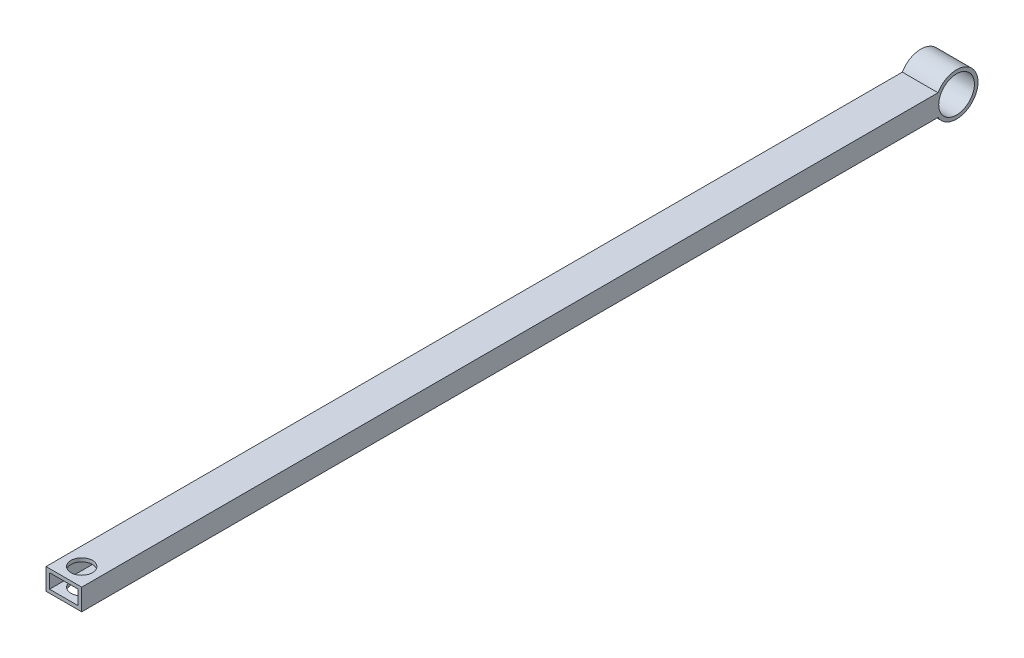
ISO-10303-21;
HEADER;
FILE_DESCRIPTION(('STEP AP214'),'2;1');
FILE_NAME('part.step','',(''),(''),'','','');
FILE_SCHEMA(('AUTOMOTIVE_DESIGN { 1 0 10303 214 1 1 1 1 }'));
ENDSEC;
DATA;
#1=APPLICATION_CONTEXT('core data for automotive mechanical design processes');
#2=APPLICATION_PROTOCOL_DEFINITION('international standard','automotive_design',2000,#1);
#3=PRODUCT_CONTEXT('',#1,'mechanical');
#4=PRODUCT('Part','Part','',(#3));
#5=PRODUCT_RELATED_PRODUCT_CATEGORY('part','',(#4));
#6=PRODUCT_DEFINITION_FORMATION('','',#4);
#7=PRODUCT_DEFINITION_CONTEXT('part definition',#1,'design');
#8=PRODUCT_DEFINITION('design','',#6,#7);
#9=PRODUCT_DEFINITION_SHAPE('','',#8);
#10=(LENGTH_UNIT() NAMED_UNIT(*) SI_UNIT(.MILLI.,.METRE.));
#11=(NAMED_UNIT(*) PLANE_ANGLE_UNIT() SI_UNIT($,.RADIAN.));
#12=(NAMED_UNIT(*) SI_UNIT($,.STERADIAN.) SOLID_ANGLE_UNIT());
#13=UNCERTAINTY_MEASURE_WITH_UNIT(LENGTH_MEASURE(1.E-05),#10,'distance_accuracy_value','');
#14=(GEOMETRIC_REPRESENTATION_CONTEXT(3) GLOBAL_UNCERTAINTY_ASSIGNED_CONTEXT((#13)) GLOBAL_UNIT_ASSIGNED_CONTEXT((#10,
#11,#12)) REPRESENTATION_CONTEXT('',''));
#15=CARTESIAN_POINT('',(0.,0.,0.));
#16=DIRECTION('',(0.,0.,1.));
#17=DIRECTION('',(1.,0.,0.));
#18=AXIS2_PLACEMENT_3D('',#15,#16,#17);
#19=CARTESIAN_POINT('',(0.,0.,250.));
#20=DIRECTION('',(0.,0.,1.));
#21=DIRECTION('',(1.,0.,0.));
#22=AXIS2_PLACEMENT_3D('',#19,#20,#21);
#23=PLANE('',#22);
#24=DIRECTION('',(0.,1.,0.));
#25=VECTOR('',#24,1.);
#26=CARTESIAN_POINT('',(5.,3.,250.));
#27=LINE('',#26,#25);
#28=CARTESIAN_POINT('',(5.,-3.,250.));
#29=VERTEX_POINT('',#28);
#30=CARTESIAN_POINT('',(5.,3.,250.));
#31=VERTEX_POINT('',#30);
#32=EDGE_CURVE('E158',#29,#31,#27,.T.);
#33=ORIENTED_EDGE('',*,*,#32,.T.);
#34=DIRECTION('',(-1.,0.,0.));
#35=VECTOR('',#34,1.);
#36=CARTESIAN_POINT('',(-5.,3.,250.));
#37=LINE('',#36,#35);
#38=CARTESIAN_POINT('',(-5.,3.,250.));
#39=VERTEX_POINT('',#38);
#40=EDGE_CURVE('E162',#31,#39,#37,.T.);
#41=ORIENTED_EDGE('',*,*,#40,.T.);
#42=DIRECTION('',(0.,-1.,0.));
#43=VECTOR('',#42,1.);
#44=CARTESIAN_POINT('',(-5.,3.,250.));
#45=LINE('',#44,#43);
#46=CARTESIAN_POINT('',(-5.,-3.,250.));
#47=VERTEX_POINT('',#46);
#48=EDGE_CURVE('E164',#39,#47,#45,.T.);
#49=ORIENTED_EDGE('',*,*,#48,.T.);
#50=DIRECTION('',(1.,0.,0.));
#51=VECTOR('',#50,1.);
#52=CARTESIAN_POINT('',(-5.,-3.,250.));
#53=LINE('',#52,#51);
#54=EDGE_CURVE('E166',#47,#29,#53,.T.);
#55=ORIENTED_EDGE('',*,*,#54,.T.);
#56=EDGE_LOOP('',(#33,#41,#49,#55));
#57=FACE_BOUND('',#56,.T.);
#58=DIRECTION('',(-1.,0.,0.));
#59=VECTOR('',#58,1.);
#60=CARTESIAN_POINT('',(-4.,2.,250.));
#61=LINE('',#60,#59);
#62=CARTESIAN_POINT('',(4.,2.,250.));
#63=VERTEX_POINT('',#62);
#64=CARTESIAN_POINT('',(-4.,2.,250.));
#65=VERTEX_POINT('',#64);
#66=EDGE_CURVE('E144',#63,#65,#61,.T.);
#67=ORIENTED_EDGE('',*,*,#66,.F.);
#68=DIRECTION('',(0.,1.,0.));
#69=VECTOR('',#68,1.);
#70=CARTESIAN_POINT('',(4.,2.,250.));
#71=LINE('',#70,#69);
#72=CARTESIAN_POINT('',(4.,-2.,250.));
#73=VERTEX_POINT('',#72);
#74=EDGE_CURVE('E142',#73,#63,#71,.T.);
#75=ORIENTED_EDGE('',*,*,#74,.F.);
#76=DIRECTION('',(1.,0.,0.));
#77=VECTOR('',#76,1.);
#78=CARTESIAN_POINT('',(-4.,-2.,250.));
#79=LINE('',#78,#77);
#80=CARTESIAN_POINT('',(-4.,-2.,250.));
#81=VERTEX_POINT('',#80);
#82=EDGE_CURVE('E110',#81,#73,#79,.T.);
#83=ORIENTED_EDGE('',*,*,#82,.F.);
#84=DIRECTION('',(0.,-1.,0.));
#85=VECTOR('',#84,1.);
#86=CARTESIAN_POINT('',(-4.,2.,250.));
#87=LINE('',#86,#85);
#88=EDGE_CURVE('E146',#65,#81,#87,.T.);
#89=ORIENTED_EDGE('',*,*,#88,.F.);
#90=EDGE_LOOP('',(#67,#75,#83,#89));
#91=FACE_BOUND('',#90,.T.);
#92=ADVANCED_FACE('F41',(#57,#91),#23,.T.);
#93=CARTESIAN_POINT('',(0.,249.,245.));
#94=DIRECTION('',(0.,-1.,0.));
#95=DIRECTION('',(0.,0.,-1.));
#96=AXIS2_PLACEMENT_3D('',#93,#94,#95);
#97=CYLINDRICAL_SURFACE('',#96,3.);
#98=CARTESIAN_POINT('',(0.,3.,245.));
#99=DIRECTION('',(0.,-1.,0.));
#100=DIRECTION('',(0.,0.,-1.));
#101=AXIS2_PLACEMENT_3D('',#98,#99,#100);
#102=CIRCLE('',#101,3.);
#103=CARTESIAN_POINT('',(0.,3.,242.));
#104=VERTEX_POINT('',#103);
#105=EDGE_CURVE('E155',#104,#104,#102,.F.);
#106=ORIENTED_EDGE('',*,*,#105,.T.);
#107=EDGE_LOOP('',(#106));
#108=FACE_BOUND('',#107,.T.);
#109=CARTESIAN_POINT('',(0.,2.,245.));
#110=DIRECTION('',(0.,-1.,0.));
#111=DIRECTION('',(0.,0.,-1.));
#112=AXIS2_PLACEMENT_3D('',#109,#110,#111);
#113=CIRCLE('',#112,3.);
#114=CARTESIAN_POINT('',(0.,2.,242.));
#115=VERTEX_POINT('',#114);
#116=EDGE_CURVE('E178',#115,#115,#113,.T.);
#117=ORIENTED_EDGE('',*,*,#116,.T.);
#118=EDGE_LOOP('',(#117));
#119=FACE_BOUND('',#118,.T.);
#120=ADVANCED_FACE('F184',(#108,#119),#97,.F.);
#121=CARTESIAN_POINT('',(0.,-3.,245.));
#122=DIRECTION('',(0.,1.,0.));
#123=DIRECTION('',(0.,0.,1.));
#124=AXIS2_PLACEMENT_3D('',#121,#122,#123);
#125=CIRCLE('',#124,3.);
#126=CARTESIAN_POINT('',(0.,-3.,248.));
#127=VERTEX_POINT('',#126);
#128=EDGE_CURVE('E159',#127,#127,#125,.F.);
#129=ORIENTED_EDGE('',*,*,#128,.T.);
#130=EDGE_LOOP('',(#129));
#131=FACE_BOUND('',#130,.T.);
#132=CARTESIAN_POINT('',(0.,-2.,245.));
#133=DIRECTION('',(0.,1.,0.));
#134=DIRECTION('',(0.,0.,1.));
#135=AXIS2_PLACEMENT_3D('',#132,#133,#134);
#136=CIRCLE('',#135,3.);
#137=CARTESIAN_POINT('',(0.,-2.,248.));
#138=VERTEX_POINT('',#137);
#139=EDGE_CURVE('E154',#138,#138,#136,.T.);
#140=ORIENTED_EDGE('',*,*,#139,.T.);
#141=EDGE_LOOP('',(#140));
#142=FACE_BOUND('',#141,.T.);
#143=ADVANCED_FACE('F204',(#131,#142),#97,.F.);
#144=CARTESIAN_POINT('',(5.,3.,250.));
#145=DIRECTION('',(-1.,0.,0.));
#146=DIRECTION('',(0.,0.,1.));
#147=AXIS2_PLACEMENT_3D('',#144,#145,#146);
#148=PLANE('',#147);
#149=CARTESIAN_POINT('',(5.,0.,5.));
#150=DIRECTION('',(-1.,0.,0.));
#151=DIRECTION('',(0.,-1.,0.));
#152=AXIS2_PLACEMENT_3D('',#149,#150,#151);
#153=CIRCLE('',#152,5.);
#154=CARTESIAN_POINT('',(5.,-5.,5.));
#155=VERTEX_POINT('',#154);
#156=EDGE_CURVE('E232',#155,#155,#153,.T.);
#157=ORIENTED_EDGE('',*,*,#156,.T.);
#158=EDGE_LOOP('',(#157));
#159=FACE_BOUND('',#158,.T.);
#160=DIRECTION('',(0.,0.,-1.));
#161=VECTOR('',#160,1.);
#162=CARTESIAN_POINT('',(5.,-3.,250.));
#163=LINE('',#162,#161);
#164=CARTESIAN_POINT('',(5.,-3.,10.1961524227066));
#165=VERTEX_POINT('',#164);
#166=EDGE_CURVE('E168',#29,#165,#163,.T.);
#167=ORIENTED_EDGE('',*,*,#166,.T.);
#168=CARTESIAN_POINT('',(5.,0.,5.));
#169=DIRECTION('',(-1.,0.,0.));
#170=DIRECTION('',(0.,-1.,0.));
#171=AXIS2_PLACEMENT_3D('',#168,#169,#170);
#172=CIRCLE('',#171,6.);
#173=CARTESIAN_POINT('',(5.,3.,10.1961524227066));
#174=VERTEX_POINT('',#173);
#175=EDGE_CURVE('E131',#174,#165,#172,.T.);
#176=ORIENTED_EDGE('',*,*,#175,.F.);
#177=DIRECTION('',(0.,0.,-1.));
#178=VECTOR('',#177,1.);
#179=CARTESIAN_POINT('',(5.,3.,250.));
#180=LINE('',#179,#178);
#181=EDGE_CURVE('E50',#31,#174,#180,.T.);
#182=ORIENTED_EDGE('',*,*,#181,.F.);
#183=ORIENTED_EDGE('',*,*,#32,.F.);
#184=EDGE_LOOP('',(#167,#176,#182,#183));
#185=FACE_BOUND('',#184,.T.);
#186=ADVANCED_FACE('F43',(#159,#185),#148,.F.);
#187=CARTESIAN_POINT('',(-5.,3.,250.));
#188=DIRECTION('',(0.,-1.,0.));
#189=DIRECTION('',(0.,0.,-1.));
#190=AXIS2_PLACEMENT_3D('',#187,#188,#189);
#191=PLANE('',#190);
#192=ORIENTED_EDGE('',*,*,#105,.F.);
#193=EDGE_LOOP('',(#192));
#194=FACE_BOUND('',#193,.T.);
#195=ORIENTED_EDGE('',*,*,#181,.T.);
#196=DIRECTION('',(-1.,0.,0.));
#197=VECTOR('',#196,1.);
#198=CARTESIAN_POINT('',(5.,3.,10.1961524227066));
#199=LINE('',#198,#197);
#200=CARTESIAN_POINT('',(-5.,3.,10.1961524227066));
#201=VERTEX_POINT('',#200);
#202=EDGE_CURVE('E60',#174,#201,#199,.T.);
#203=ORIENTED_EDGE('',*,*,#202,.T.);
#204=DIRECTION('',(0.,0.,-1.));
#205=VECTOR('',#204,1.);
#206=CARTESIAN_POINT('',(-5.,3.,250.));
#207=LINE('',#206,#205);
#208=EDGE_CURVE('E173',#39,#201,#207,.T.);
#209=ORIENTED_EDGE('',*,*,#208,.F.);
#210=ORIENTED_EDGE('',*,*,#40,.F.);
#211=EDGE_LOOP('',(#195,#203,#209,#210));
#212=FACE_BOUND('',#211,.T.);
#213=ADVANCED_FACE('F215',(#194,#212),#191,.F.);
#214=CARTESIAN_POINT('',(-5.,3.,250.));
#215=DIRECTION('',(1.,0.,0.));
#216=DIRECTION('',(0.,1.,0.));
#217=AXIS2_PLACEMENT_3D('',#214,#215,#216);
#218=PLANE('',#217);
#219=CARTESIAN_POINT('',(-5.,0.,5.));
#220=DIRECTION('',(1.,0.,0.));
#221=DIRECTION('',(0.,1.,0.));
#222=AXIS2_PLACEMENT_3D('',#219,#220,#221);
#223=CIRCLE('',#222,5.);
#224=CARTESIAN_POINT('',(-5.,5.,5.));
#225=VERTEX_POINT('',#224);
#226=EDGE_CURVE('E45',#225,#225,#223,.T.);
#227=ORIENTED_EDGE('',*,*,#226,.T.);
#228=EDGE_LOOP('',(#227));
#229=FACE_BOUND('',#228,.T.);
#230=ORIENTED_EDGE('',*,*,#208,.T.);
#231=CARTESIAN_POINT('',(-5.,0.,5.));
#232=DIRECTION('',(-1.,0.,0.));
#233=DIRECTION('',(0.,-1.,0.));
#234=AXIS2_PLACEMENT_3D('',#231,#232,#233);
#235=CIRCLE('',#234,6.);
#236=CARTESIAN_POINT('',(-5.,-3.,10.1961524227066));
#237=VERTEX_POINT('',#236);
#238=EDGE_CURVE('E134',#201,#237,#235,.T.);
#239=ORIENTED_EDGE('',*,*,#238,.T.);
#240=DIRECTION('',(0.,0.,-1.));
#241=VECTOR('',#240,1.);
#242=CARTESIAN_POINT('',(-5.,-3.,250.));
#243=LINE('',#242,#241);
#244=EDGE_CURVE('E171',#47,#237,#243,.T.);
#245=ORIENTED_EDGE('',*,*,#244,.F.);
#246=ORIENTED_EDGE('',*,*,#48,.F.);
#247=EDGE_LOOP('',(#230,#239,#245,#246));
#248=FACE_BOUND('',#247,.T.);
#249=ADVANCED_FACE('F212',(#229,#248),#218,.F.);
#250=CARTESIAN_POINT('',(-5.,-3.,250.));
#251=DIRECTION('',(0.,1.,0.));
#252=DIRECTION('',(0.,0.,1.));
#253=AXIS2_PLACEMENT_3D('',#250,#251,#252);
#254=PLANE('',#253);
#255=ORIENTED_EDGE('',*,*,#128,.F.);
#256=EDGE_LOOP('',(#255));
#257=FACE_BOUND('',#256,.T.);
#258=ORIENTED_EDGE('',*,*,#244,.T.);
#259=DIRECTION('',(-1.,0.,0.));
#260=VECTOR('',#259,1.);
#261=CARTESIAN_POINT('',(5.,-3.,10.1961524227066));
#262=LINE('',#261,#260);
#263=EDGE_CURVE('E139',#237,#165,#262,.F.);
#264=ORIENTED_EDGE('',*,*,#263,.T.);
#265=ORIENTED_EDGE('',*,*,#166,.F.);
#266=ORIENTED_EDGE('',*,*,#54,.F.);
#267=EDGE_LOOP('',(#258,#264,#265,#266));
#268=FACE_BOUND('',#267,.T.);
#269=ADVANCED_FACE('F209',(#257,#268),#254,.F.);
#270=CARTESIAN_POINT('',(4.,2.,250.));
#271=DIRECTION('',(-1.,0.,0.));
#272=DIRECTION('',(0.,0.,1.));
#273=AXIS2_PLACEMENT_3D('',#270,#271,#272);
#274=PLANE('',#273);
#275=CARTESIAN_POINT('',(4.,0.,5.));
#276=DIRECTION('',(-1.,0.,0.));
#277=DIRECTION('',(0.,0.,1.));
#278=AXIS2_PLACEMENT_3D('',#275,#276,#277);
#279=CIRCLE('',#278,6.);
#280=CARTESIAN_POINT('',(4.,-2.,10.6568542494924));
#281=VERTEX_POINT('',#280);
#282=CARTESIAN_POINT('',(4.,2.,10.6568542494924));
#283=VERTEX_POINT('',#282);
#284=EDGE_CURVE('E117',#281,#283,#279,.T.);
#285=ORIENTED_EDGE('',*,*,#284,.F.);
#286=DIRECTION('',(0.,0.,-1.));
#287=VECTOR('',#286,1.);
#288=CARTESIAN_POINT('',(4.,-2.,250.));
#289=LINE('',#288,#287);
#290=EDGE_CURVE('E104',#73,#281,#289,.T.);
#291=ORIENTED_EDGE('',*,*,#290,.F.);
#292=ORIENTED_EDGE('',*,*,#74,.T.);
#293=DIRECTION('',(0.,0.,-1.));
#294=VECTOR('',#293,1.);
#295=CARTESIAN_POINT('',(4.,2.,250.));
#296=LINE('',#295,#294);
#297=EDGE_CURVE('E120',#63,#283,#296,.T.);
#298=ORIENTED_EDGE('',*,*,#297,.T.);
#299=EDGE_LOOP('',(#285,#291,#292,#298));
#300=FACE_BOUND('',#299,.T.);
#301=ADVANCED_FACE('F118',(#300),#274,.T.);
#302=CARTESIAN_POINT('',(-4.,2.,250.));
#303=DIRECTION('',(1.,0.,0.));
#304=DIRECTION('',(0.,0.,-1.));
#305=AXIS2_PLACEMENT_3D('',#302,#303,#304);
#306=PLANE('',#305);
#307=CARTESIAN_POINT('',(-4.,0.,5.));
#308=DIRECTION('',(1.,0.,0.));
#309=DIRECTION('',(0.,0.,-1.));
#310=AXIS2_PLACEMENT_3D('',#307,#308,#309);
#311=CIRCLE('',#310,6.);
#312=CARTESIAN_POINT('',(-4.,2.,10.6568542494924));
#313=VERTEX_POINT('',#312);
#314=CARTESIAN_POINT('',(-4.,-2.,10.6568542494924));
#315=VERTEX_POINT('',#314);
#316=EDGE_CURVE('E124',#313,#315,#311,.T.);
#317=ORIENTED_EDGE('',*,*,#316,.F.);
#318=DIRECTION('',(0.,0.,-1.));
#319=VECTOR('',#318,1.);
#320=CARTESIAN_POINT('',(-4.,2.,250.));
#321=LINE('',#320,#319);
#322=EDGE_CURVE('E151',#65,#313,#321,.T.);
#323=ORIENTED_EDGE('',*,*,#322,.F.);
#324=ORIENTED_EDGE('',*,*,#88,.T.);
#325=DIRECTION('',(0.,0.,-1.));
#326=VECTOR('',#325,1.);
#327=CARTESIAN_POINT('',(-4.,-2.,250.));
#328=LINE('',#327,#326);
#329=EDGE_CURVE('E113',#81,#315,#328,.T.);
#330=ORIENTED_EDGE('',*,*,#329,.T.);
#331=EDGE_LOOP('',(#317,#323,#324,#330));
#332=FACE_BOUND('',#331,.T.);
#333=ADVANCED_FACE('F188',(#332),#306,.T.);
#334=CARTESIAN_POINT('',(-4.,2.,250.));
#335=DIRECTION('',(0.,-1.,0.));
#336=DIRECTION('',(0.,0.,-1.));
#337=AXIS2_PLACEMENT_3D('',#334,#335,#336);
#338=PLANE('',#337);
#339=DIRECTION('',(-1.,0.,0.));
#340=VECTOR('',#339,1.);
#341=CARTESIAN_POINT('',(5.,2.,10.6568542494924));
#342=LINE('',#341,#340);
#343=EDGE_CURVE('E123',#283,#313,#342,.T.);
#344=ORIENTED_EDGE('',*,*,#343,.F.);
#345=ORIENTED_EDGE('',*,*,#297,.F.);
#346=ORIENTED_EDGE('',*,*,#66,.T.);
#347=ORIENTED_EDGE('',*,*,#322,.T.);
#348=EDGE_LOOP('',(#344,#345,#346,#347));
#349=FACE_BOUND('',#348,.T.);
#350=ORIENTED_EDGE('',*,*,#116,.F.);
#351=EDGE_LOOP('',(#350));
#352=FACE_BOUND('',#351,.T.);
#353=ADVANCED_FACE('F186',(#349,#352),#338,.T.);
#354=CARTESIAN_POINT('',(-4.,-2.,250.));
#355=DIRECTION('',(0.,1.,0.));
#356=DIRECTION('',(0.,0.,1.));
#357=AXIS2_PLACEMENT_3D('',#354,#355,#356);
#358=PLANE('',#357);
#359=DIRECTION('',(-1.,0.,0.));
#360=VECTOR('',#359,1.);
#361=CARTESIAN_POINT('',(5.,-2.,10.6568542494924));
#362=LINE('',#361,#360);
#363=EDGE_CURVE('E11',#315,#281,#362,.F.);
#364=ORIENTED_EDGE('',*,*,#363,.F.);
#365=ORIENTED_EDGE('',*,*,#329,.F.);
#366=ORIENTED_EDGE('',*,*,#82,.T.);
#367=ORIENTED_EDGE('',*,*,#290,.T.);
#368=EDGE_LOOP('',(#364,#365,#366,#367));
#369=FACE_BOUND('',#368,.T.);
#370=ORIENTED_EDGE('',*,*,#139,.F.);
#371=EDGE_LOOP('',(#370));
#372=FACE_BOUND('',#371,.T.);
#373=ADVANCED_FACE('F106',(#369,#372),#358,.T.);
#374=CARTESIAN_POINT('',(5.,0.,5.));
#375=DIRECTION('',(-1.,0.,0.));
#376=DIRECTION('',(0.,-1.,0.));
#377=AXIS2_PLACEMENT_3D('',#374,#375,#376);
#378=CYLINDRICAL_SURFACE('',#377,6.);
#379=ORIENTED_EDGE('',*,*,#284,.T.);
#380=ORIENTED_EDGE('',*,*,#343,.T.);
#381=ORIENTED_EDGE('',*,*,#316,.T.);
#382=ORIENTED_EDGE('',*,*,#363,.T.);
#383=EDGE_LOOP('',(#379,#380,#381,#382));
#384=FACE_BOUND('',#383,.T.);
#385=ADVANCED_FACE('F127',(#384),#378,.T.);
#386=ORIENTED_EDGE('',*,*,#202,.F.);
#387=ORIENTED_EDGE('',*,*,#175,.T.);
#388=ORIENTED_EDGE('',*,*,#263,.F.);
#389=ORIENTED_EDGE('',*,*,#238,.F.);
#390=EDGE_LOOP('',(#386,#387,#388,#389));
#391=FACE_BOUND('',#390,.T.);
#392=ADVANCED_FACE('F240',(#391),#378,.T.);
#393=CARTESIAN_POINT('',(5.,0.,5.));
#394=DIRECTION('',(-1.,0.,0.));
#395=DIRECTION('',(0.,-1.,0.));
#396=AXIS2_PLACEMENT_3D('',#393,#394,#395);
#397=CYLINDRICAL_SURFACE('',#396,5.);
#398=ORIENTED_EDGE('',*,*,#156,.F.);
#399=EDGE_LOOP('',(#398));
#400=FACE_BOUND('',#399,.T.);
#401=ORIENTED_EDGE('',*,*,#226,.F.);
#402=EDGE_LOOP('',(#401));
#403=FACE_BOUND('',#402,.T.);
#404=ADVANCED_FACE('F249',(#400,#403),#397,.F.);
#405=CLOSED_SHELL('',(#92,#120,#143,#186,#213,#249,#269,#301,#333,#353,#373,#385,#392,#404));
#406=MANIFOLD_SOLID_BREP('B2',#405);
#407=ADVANCED_BREP_SHAPE_REPRESENTATION('',(#18,#406),#14);
#408=SHAPE_DEFINITION_REPRESENTATION(#9,#407);
ENDSEC;
END-ISO-10303-21;
